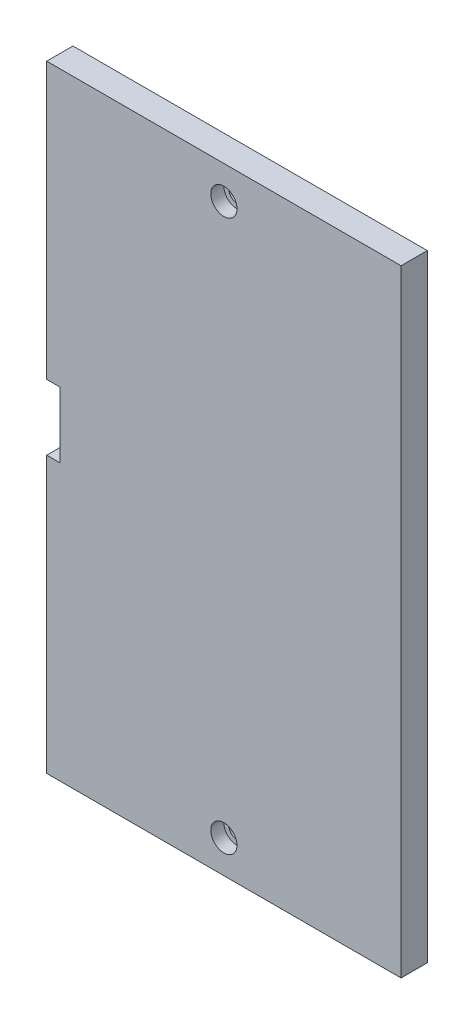
ISO-10303-21;
HEADER;
FILE_DESCRIPTION(('STEP AP214'),'2;1');
FILE_NAME('part.step','',(''),(''),'','','');
FILE_SCHEMA(('AUTOMOTIVE_DESIGN { 1 0 10303 214 1 1 1 1 }'));
ENDSEC;
DATA;
#1=APPLICATION_CONTEXT('core data for automotive mechanical design processes');
#2=APPLICATION_PROTOCOL_DEFINITION('international standard','automotive_design',2000,#1);
#3=PRODUCT_CONTEXT('',#1,'mechanical');
#4=PRODUCT('Part','Part','',(#3));
#5=PRODUCT_RELATED_PRODUCT_CATEGORY('part','',(#4));
#6=PRODUCT_DEFINITION_FORMATION('','',#4);
#7=PRODUCT_DEFINITION_CONTEXT('part definition',#1,'design');
#8=PRODUCT_DEFINITION('design','',#6,#7);
#9=PRODUCT_DEFINITION_SHAPE('','',#8);
#10=(LENGTH_UNIT() NAMED_UNIT(*) SI_UNIT(.MILLI.,.METRE.));
#11=(NAMED_UNIT(*) PLANE_ANGLE_UNIT() SI_UNIT($,.RADIAN.));
#12=(NAMED_UNIT(*) SI_UNIT($,.STERADIAN.) SOLID_ANGLE_UNIT());
#13=UNCERTAINTY_MEASURE_WITH_UNIT(LENGTH_MEASURE(1.E-05),#10,'distance_accuracy_value','');
#14=(GEOMETRIC_REPRESENTATION_CONTEXT(3) GLOBAL_UNCERTAINTY_ASSIGNED_CONTEXT((#13)) GLOBAL_UNIT_ASSIGNED_CONTEXT((#10,
#11,#12)) REPRESENTATION_CONTEXT('',''));
#15=CARTESIAN_POINT('',(0.,0.,0.));
#16=DIRECTION('',(0.,0.,1.));
#17=DIRECTION('',(1.,0.,0.));
#18=AXIS2_PLACEMENT_3D('',#15,#16,#17);
#19=CARTESIAN_POINT('',(27.,5.,0.));
#20=DIRECTION('',(0.,0.,1.));
#21=DIRECTION('',(1.,0.,0.));
#22=AXIS2_PLACEMENT_3D('',#19,#20,#21);
#23=CYLINDRICAL_SURFACE('',#22,1.25);
#24=CARTESIAN_POINT('',(27.,5.,0.));
#25=DIRECTION('',(0.,0.,1.));
#26=DIRECTION('',(1.,0.,0.));
#27=AXIS2_PLACEMENT_3D('',#24,#25,#26);
#28=CIRCLE('',#27,1.25);
#29=CARTESIAN_POINT('',(28.25,5.,0.));
#30=VERTEX_POINT('',#29);
#31=EDGE_CURVE('E165',#30,#30,#28,.T.);
#32=ORIENTED_EDGE('',*,*,#31,.F.);
#33=EDGE_LOOP('',(#32));
#34=FACE_BOUND('',#33,.T.);
#35=CARTESIAN_POINT('',(27.,5.,2.));
#36=DIRECTION('',(0.,0.,1.));
#37=DIRECTION('',(1.,0.,0.));
#38=AXIS2_PLACEMENT_3D('',#35,#36,#37);
#39=CIRCLE('',#38,1.25);
#40=CARTESIAN_POINT('',(28.25,5.,2.));
#41=VERTEX_POINT('',#40);
#42=EDGE_CURVE('E40',#41,#41,#39,.F.);
#43=ORIENTED_EDGE('',*,*,#42,.F.);
#44=EDGE_LOOP('',(#43));
#45=FACE_BOUND('',#44,.T.);
#46=ADVANCED_FACE('F35',(#34,#45),#23,.F.);
#47=CARTESIAN_POINT('',(27.,89.,0.));
#48=DIRECTION('',(0.,0.,1.));
#49=DIRECTION('',(1.,0.,0.));
#50=AXIS2_PLACEMENT_3D('',#47,#48,#49);
#51=CYLINDRICAL_SURFACE('',#50,1.25);
#52=CARTESIAN_POINT('',(27.,89.,0.));
#53=DIRECTION('',(0.,0.,1.));
#54=DIRECTION('',(1.,0.,0.));
#55=AXIS2_PLACEMENT_3D('',#52,#53,#54);
#56=CIRCLE('',#55,1.25);
#57=CARTESIAN_POINT('',(28.25,89.,0.));
#58=VERTEX_POINT('',#57);
#59=EDGE_CURVE('E128',#58,#58,#56,.T.);
#60=ORIENTED_EDGE('',*,*,#59,.F.);
#61=EDGE_LOOP('',(#60));
#62=FACE_BOUND('',#61,.T.);
#63=CARTESIAN_POINT('',(27.,89.,2.));
#64=DIRECTION('',(0.,0.,1.));
#65=DIRECTION('',(1.,0.,0.));
#66=AXIS2_PLACEMENT_3D('',#63,#64,#65);
#67=CIRCLE('',#66,1.25);
#68=CARTESIAN_POINT('',(28.25,89.,2.));
#69=VERTEX_POINT('',#68);
#70=EDGE_CURVE('E159',#69,#69,#67,.F.);
#71=ORIENTED_EDGE('',*,*,#70,.F.);
#72=EDGE_LOOP('',(#71));
#73=FACE_BOUND('',#72,.T.);
#74=ADVANCED_FACE('F236',(#62,#73),#51,.F.);
#75=CARTESIAN_POINT('',(0.,0.,4.));
#76=DIRECTION('',(1.,0.,0.));
#77=DIRECTION('',(0.,0.,-1.));
#78=AXIS2_PLACEMENT_3D('',#75,#76,#77);
#79=PLANE('',#78);
#80=DIRECTION('',(0.,-1.,0.));
#81=VECTOR('',#80,1.);
#82=CARTESIAN_POINT('',(0.,0.,0.));
#83=LINE('',#82,#81);
#84=CARTESIAN_POINT('',(0.,94.,0.));
#85=VERTEX_POINT('',#84);
#86=CARTESIAN_POINT('',(0.,52.,0.));
#87=VERTEX_POINT('',#86);
#88=EDGE_CURVE('E124',#85,#87,#83,.T.);
#89=ORIENTED_EDGE('',*,*,#88,.T.);
#90=DIRECTION('',(0.,0.,1.));
#91=VECTOR('',#90,1.);
#92=CARTESIAN_POINT('',(0.,52.,-0.00100000000000013));
#93=LINE('',#92,#91);
#94=CARTESIAN_POINT('',(0.,52.,4.));
#95=VERTEX_POINT('',#94);
#96=EDGE_CURVE('E106',#87,#95,#93,.T.);
#97=ORIENTED_EDGE('',*,*,#96,.T.);
#98=DIRECTION('',(0.,-1.,0.));
#99=VECTOR('',#98,1.);
#100=CARTESIAN_POINT('',(0.,0.,4.));
#101=LINE('',#100,#99);
#102=CARTESIAN_POINT('',(0.,94.,4.));
#103=VERTEX_POINT('',#102);
#104=EDGE_CURVE('E196',#103,#95,#101,.T.);
#105=ORIENTED_EDGE('',*,*,#104,.F.);
#106=DIRECTION('',(0.,0.,-1.));
#107=VECTOR('',#106,1.);
#108=CARTESIAN_POINT('',(0.,94.,4.));
#109=LINE('',#108,#107);
#110=EDGE_CURVE('E133',#103,#85,#109,.T.);
#111=ORIENTED_EDGE('',*,*,#110,.T.);
#112=EDGE_LOOP('',(#89,#97,#105,#111));
#113=FACE_BOUND('',#112,.T.);
#114=ADVANCED_FACE('F131',(#113),#79,.F.);
#115=CARTESIAN_POINT('',(0.,42.,4.));
#116=VERTEX_POINT('',#115);
#117=CARTESIAN_POINT('',(0.,0.,4.));
#118=VERTEX_POINT('',#117);
#119=EDGE_CURVE('E146',#116,#118,#101,.T.);
#120=ORIENTED_EDGE('',*,*,#119,.F.);
#121=DIRECTION('',(0.,0.,1.));
#122=VECTOR('',#121,1.);
#123=CARTESIAN_POINT('',(0.,42.,-0.00100000000000013));
#124=LINE('',#123,#122);
#125=CARTESIAN_POINT('',(0.,42.,0.));
#126=VERTEX_POINT('',#125);
#127=EDGE_CURVE('E189',#126,#116,#124,.T.);
#128=ORIENTED_EDGE('',*,*,#127,.F.);
#129=CARTESIAN_POINT('',(0.,0.,0.));
#130=VERTEX_POINT('',#129);
#131=EDGE_CURVE('E135',#126,#130,#83,.T.);
#132=ORIENTED_EDGE('',*,*,#131,.T.);
#133=DIRECTION('',(0.,0.,-1.));
#134=VECTOR('',#133,1.);
#135=CARTESIAN_POINT('',(0.,0.,4.));
#136=LINE('',#135,#134);
#137=EDGE_CURVE('E154',#118,#130,#136,.T.);
#138=ORIENTED_EDGE('',*,*,#137,.F.);
#139=EDGE_LOOP('',(#120,#128,#132,#138));
#140=FACE_BOUND('',#139,.T.);
#141=ADVANCED_FACE('F219',(#140),#79,.F.);
#142=CARTESIAN_POINT('',(0.,0.,4.));
#143=DIRECTION('',(0.,1.,0.));
#144=DIRECTION('',(0.,0.,1.));
#145=AXIS2_PLACEMENT_3D('',#142,#143,#144);
#146=PLANE('',#145);
#147=DIRECTION('',(1.,0.,0.));
#148=VECTOR('',#147,1.);
#149=CARTESIAN_POINT('',(0.,0.,0.));
#150=LINE('',#149,#148);
#151=CARTESIAN_POINT('',(54.,0.,0.));
#152=VERTEX_POINT('',#151);
#153=EDGE_CURVE('E134',#130,#152,#150,.T.);
#154=ORIENTED_EDGE('',*,*,#153,.T.);
#155=DIRECTION('',(0.,0.,-1.));
#156=VECTOR('',#155,1.);
#157=CARTESIAN_POINT('',(54.,0.,4.));
#158=LINE('',#157,#156);
#159=CARTESIAN_POINT('',(54.,0.,4.));
#160=VERTEX_POINT('',#159);
#161=EDGE_CURVE('E151',#160,#152,#158,.T.);
#162=ORIENTED_EDGE('',*,*,#161,.F.);
#163=DIRECTION('',(1.,0.,0.));
#164=VECTOR('',#163,1.);
#165=CARTESIAN_POINT('',(0.,0.,4.));
#166=LINE('',#165,#164);
#167=EDGE_CURVE('E198',#118,#160,#166,.T.);
#168=ORIENTED_EDGE('',*,*,#167,.F.);
#169=ORIENTED_EDGE('',*,*,#137,.T.);
#170=EDGE_LOOP('',(#154,#162,#168,#169));
#171=FACE_BOUND('',#170,.T.);
#172=ADVANCED_FACE('F215',(#171),#146,.F.);
#173=CARTESIAN_POINT('',(54.,0.,4.));
#174=DIRECTION('',(-1.,0.,0.));
#175=DIRECTION('',(0.,0.,1.));
#176=AXIS2_PLACEMENT_3D('',#173,#174,#175);
#177=PLANE('',#176);
#178=DIRECTION('',(0.,1.,0.));
#179=VECTOR('',#178,1.);
#180=CARTESIAN_POINT('',(54.,0.,0.));
#181=LINE('',#180,#179);
#182=CARTESIAN_POINT('',(54.,94.,0.));
#183=VERTEX_POINT('',#182);
#184=EDGE_CURVE('E137',#152,#183,#181,.T.);
#185=ORIENTED_EDGE('',*,*,#184,.T.);
#186=DIRECTION('',(0.,0.,-1.));
#187=VECTOR('',#186,1.);
#188=CARTESIAN_POINT('',(54.,94.,4.));
#189=LINE('',#188,#187);
#190=CARTESIAN_POINT('',(54.,94.,4.));
#191=VERTEX_POINT('',#190);
#192=EDGE_CURVE('E148',#191,#183,#189,.T.);
#193=ORIENTED_EDGE('',*,*,#192,.F.);
#194=DIRECTION('',(0.,1.,0.));
#195=VECTOR('',#194,1.);
#196=CARTESIAN_POINT('',(54.,0.,4.));
#197=LINE('',#196,#195);
#198=EDGE_CURVE('E199',#160,#191,#197,.T.);
#199=ORIENTED_EDGE('',*,*,#198,.F.);
#200=ORIENTED_EDGE('',*,*,#161,.T.);
#201=EDGE_LOOP('',(#185,#193,#199,#200));
#202=FACE_BOUND('',#201,.T.);
#203=ADVANCED_FACE('F211',(#202),#177,.F.);
#204=CARTESIAN_POINT('',(0.,94.,4.));
#205=DIRECTION('',(0.,-1.,0.));
#206=DIRECTION('',(0.,0.,-1.));
#207=AXIS2_PLACEMENT_3D('',#204,#205,#206);
#208=PLANE('',#207);
#209=DIRECTION('',(-1.,0.,0.));
#210=VECTOR('',#209,1.);
#211=CARTESIAN_POINT('',(0.,94.,0.));
#212=LINE('',#211,#210);
#213=EDGE_CURVE('E144',#183,#85,#212,.T.);
#214=ORIENTED_EDGE('',*,*,#213,.T.);
#215=ORIENTED_EDGE('',*,*,#110,.F.);
#216=DIRECTION('',(-1.,0.,0.));
#217=VECTOR('',#216,1.);
#218=CARTESIAN_POINT('',(0.,94.,4.));
#219=LINE('',#218,#217);
#220=EDGE_CURVE('E140',#191,#103,#219,.T.);
#221=ORIENTED_EDGE('',*,*,#220,.F.);
#222=ORIENTED_EDGE('',*,*,#192,.T.);
#223=EDGE_LOOP('',(#214,#215,#221,#222));
#224=FACE_BOUND('',#223,.T.);
#225=ADVANCED_FACE('F206',(#224),#208,.F.);
#226=CARTESIAN_POINT('',(0.,0.,4.));
#227=DIRECTION('',(0.,0.,-1.));
#228=DIRECTION('',(-1.,0.,0.));
#229=AXIS2_PLACEMENT_3D('',#226,#227,#228);
#230=PLANE('',#229);
#231=CARTESIAN_POINT('',(27.,89.,4.));
#232=DIRECTION('',(0.,0.,1.));
#233=DIRECTION('',(1.,0.,0.));
#234=AXIS2_PLACEMENT_3D('',#231,#232,#233);
#235=CIRCLE('',#234,2.);
#236=CARTESIAN_POINT('',(29.,89.,4.));
#237=VERTEX_POINT('',#236);
#238=EDGE_CURVE('E167',#237,#237,#235,.T.);
#239=ORIENTED_EDGE('',*,*,#238,.F.);
#240=EDGE_LOOP('',(#239));
#241=FACE_BOUND('',#240,.T.);
#242=CARTESIAN_POINT('',(27.,5.,4.));
#243=DIRECTION('',(0.,0.,1.));
#244=DIRECTION('',(1.,0.,0.));
#245=AXIS2_PLACEMENT_3D('',#242,#243,#244);
#246=CIRCLE('',#245,2.);
#247=CARTESIAN_POINT('',(29.,5.,4.));
#248=VERTEX_POINT('',#247);
#249=EDGE_CURVE('E177',#248,#248,#246,.T.);
#250=ORIENTED_EDGE('',*,*,#249,.F.);
#251=EDGE_LOOP('',(#250));
#252=FACE_BOUND('',#251,.T.);
#253=ORIENTED_EDGE('',*,*,#104,.T.);
#254=DIRECTION('',(-1.,0.,0.));
#255=VECTOR('',#254,1.);
#256=CARTESIAN_POINT('',(0.,52.,4.));
#257=LINE('',#256,#255);
#258=CARTESIAN_POINT('',(2.00000000000001,52.,4.));
#259=VERTEX_POINT('',#258);
#260=EDGE_CURVE('E111',#259,#95,#257,.T.);
#261=ORIENTED_EDGE('',*,*,#260,.F.);
#262=DIRECTION('',(0.,1.,0.));
#263=VECTOR('',#262,1.);
#264=CARTESIAN_POINT('',(2.00000000000001,52.,4.));
#265=LINE('',#264,#263);
#266=CARTESIAN_POINT('',(2.00000000000001,42.,4.));
#267=VERTEX_POINT('',#266);
#268=EDGE_CURVE('E186',#267,#259,#265,.T.);
#269=ORIENTED_EDGE('',*,*,#268,.F.);
#270=DIRECTION('',(1.,0.,0.));
#271=VECTOR('',#270,1.);
#272=CARTESIAN_POINT('',(2.00000000000001,42.,4.));
#273=LINE('',#272,#271);
#274=EDGE_CURVE('E127',#116,#267,#273,.T.);
#275=ORIENTED_EDGE('',*,*,#274,.F.);
#276=ORIENTED_EDGE('',*,*,#119,.T.);
#277=ORIENTED_EDGE('',*,*,#167,.T.);
#278=ORIENTED_EDGE('',*,*,#198,.T.);
#279=ORIENTED_EDGE('',*,*,#220,.T.);
#280=EDGE_LOOP('',(#253,#261,#269,#275,#276,#277,#278,#279));
#281=FACE_BOUND('',#280,.T.);
#282=ADVANCED_FACE('F204',(#241,#252,#281),#230,.F.);
#283=CARTESIAN_POINT('',(0.,0.,0.));
#284=DIRECTION('',(0.,0.,-1.));
#285=DIRECTION('',(-1.,0.,0.));
#286=AXIS2_PLACEMENT_3D('',#283,#284,#285);
#287=PLANE('',#286);
#288=ORIENTED_EDGE('',*,*,#59,.T.);
#289=EDGE_LOOP('',(#288));
#290=FACE_BOUND('',#289,.T.);
#291=ORIENTED_EDGE('',*,*,#31,.T.);
#292=EDGE_LOOP('',(#291));
#293=FACE_BOUND('',#292,.T.);
#294=DIRECTION('',(0.,1.,0.));
#295=VECTOR('',#294,1.);
#296=CARTESIAN_POINT('',(3.00000000000002,52.,0.));
#297=LINE('',#296,#295);
#298=CARTESIAN_POINT('',(3.00000000000002,42.,0.));
#299=VERTEX_POINT('',#298);
#300=CARTESIAN_POINT('',(3.00000000000002,52.,0.));
#301=VERTEX_POINT('',#300);
#302=EDGE_CURVE('E126',#299,#301,#297,.T.);
#303=ORIENTED_EDGE('',*,*,#302,.T.);
#304=DIRECTION('',(-1.,0.,0.));
#305=VECTOR('',#304,1.);
#306=CARTESIAN_POINT('',(0.,52.,0.));
#307=LINE('',#306,#305);
#308=EDGE_CURVE('E109',#301,#87,#307,.T.);
#309=ORIENTED_EDGE('',*,*,#308,.T.);
#310=ORIENTED_EDGE('',*,*,#88,.F.);
#311=ORIENTED_EDGE('',*,*,#213,.F.);
#312=ORIENTED_EDGE('',*,*,#184,.F.);
#313=ORIENTED_EDGE('',*,*,#153,.F.);
#314=ORIENTED_EDGE('',*,*,#131,.F.);
#315=DIRECTION('',(1.,0.,0.));
#316=VECTOR('',#315,1.);
#317=CARTESIAN_POINT('',(2.00000000000001,42.,0.));
#318=LINE('',#317,#316);
#319=EDGE_CURVE('E116',#126,#299,#318,.T.);
#320=ORIENTED_EDGE('',*,*,#319,.T.);
#321=EDGE_LOOP('',(#303,#309,#310,#311,#312,#313,#314,#320));
#322=FACE_BOUND('',#321,.T.);
#323=ADVANCED_FACE('F122',(#290,#293,#322),#287,.T.);
#324=CARTESIAN_POINT('',(0.,52.,-0.00100000000000013));
#325=DIRECTION('',(0.,1.,0.));
#326=DIRECTION('',(0.,0.,1.));
#327=AXIS2_PLACEMENT_3D('',#324,#325,#326);
#328=PLANE('',#327);
#329=ORIENTED_EDGE('',*,*,#308,.F.);
#330=DIRECTION('',(-0.707106781186548,0.,0.707106781186548));
#331=VECTOR('',#330,1.);
#332=CARTESIAN_POINT('',(1.50050000000001,52.,1.49950000000001));
#333=LINE('',#332,#331);
#334=CARTESIAN_POINT('',(2.00000000000001,52.,1.00000000000001));
#335=VERTEX_POINT('',#334);
#336=EDGE_CURVE('E45',#301,#335,#333,.T.);
#337=ORIENTED_EDGE('',*,*,#336,.T.);
#338=DIRECTION('',(0.,0.,1.));
#339=VECTOR('',#338,1.);
#340=CARTESIAN_POINT('',(2.00000000000001,52.,-0.00100000000000013));
#341=LINE('',#340,#339);
#342=EDGE_CURVE('E117',#335,#259,#341,.T.);
#343=ORIENTED_EDGE('',*,*,#342,.T.);
#344=ORIENTED_EDGE('',*,*,#260,.T.);
#345=ORIENTED_EDGE('',*,*,#96,.F.);
#346=EDGE_LOOP('',(#329,#337,#343,#344,#345));
#347=FACE_BOUND('',#346,.T.);
#348=ADVANCED_FACE('F108',(#347),#328,.F.);
#349=CARTESIAN_POINT('',(2.00000000000001,52.,-0.00100000000000013));
#350=DIRECTION('',(1.,0.,0.));
#351=DIRECTION('',(0.,1.,0.));
#352=AXIS2_PLACEMENT_3D('',#349,#350,#351);
#353=PLANE('',#352);
#354=ORIENTED_EDGE('',*,*,#342,.F.);
#355=DIRECTION('',(0.,-1.,0.));
#356=VECTOR('',#355,1.);
#357=CARTESIAN_POINT('',(2.00000000000001,42.,1.00000000000001));
#358=LINE('',#357,#356);
#359=CARTESIAN_POINT('',(2.00000000000001,42.,1.00000000000001));
#360=VERTEX_POINT('',#359);
#361=EDGE_CURVE('E59',#335,#360,#358,.T.);
#362=ORIENTED_EDGE('',*,*,#361,.T.);
#363=DIRECTION('',(0.,0.,1.));
#364=VECTOR('',#363,1.);
#365=CARTESIAN_POINT('',(2.00000000000001,42.,-0.00100000000000013));
#366=LINE('',#365,#364);
#367=EDGE_CURVE('E192',#360,#267,#366,.T.);
#368=ORIENTED_EDGE('',*,*,#367,.T.);
#369=ORIENTED_EDGE('',*,*,#268,.T.);
#370=EDGE_LOOP('',(#354,#362,#368,#369));
#371=FACE_BOUND('',#370,.T.);
#372=ADVANCED_FACE('F233',(#371),#353,.F.);
#373=CARTESIAN_POINT('',(2.00000000000001,42.,-0.00100000000000013));
#374=DIRECTION('',(0.,-1.,0.));
#375=DIRECTION('',(0.,0.,-1.));
#376=AXIS2_PLACEMENT_3D('',#373,#374,#375);
#377=PLANE('',#376);
#378=ORIENTED_EDGE('',*,*,#127,.T.);
#379=ORIENTED_EDGE('',*,*,#274,.T.);
#380=ORIENTED_EDGE('',*,*,#367,.F.);
#381=DIRECTION('',(0.707106781186548,0.,-0.707106781186548));
#382=VECTOR('',#381,1.);
#383=CARTESIAN_POINT('',(2.50050000000002,42.,0.499500000000007));
#384=LINE('',#383,#382);
#385=EDGE_CURVE('E11',#360,#299,#384,.T.);
#386=ORIENTED_EDGE('',*,*,#385,.T.);
#387=ORIENTED_EDGE('',*,*,#319,.F.);
#388=EDGE_LOOP('',(#378,#379,#380,#386,#387));
#389=FACE_BOUND('',#388,.T.);
#390=ADVANCED_FACE('F223',(#389),#377,.F.);
#391=CARTESIAN_POINT('',(3.00000000000003,0.,0.));
#392=DIRECTION('',(-0.707106781186547,0.,-0.707106781186547));
#393=DIRECTION('',(0.,-1.,0.));
#394=AXIS2_PLACEMENT_3D('',#391,#392,#393);
#395=PLANE('',#394);
#396=ORIENTED_EDGE('',*,*,#385,.F.);
#397=ORIENTED_EDGE('',*,*,#361,.F.);
#398=ORIENTED_EDGE('',*,*,#336,.F.);
#399=ORIENTED_EDGE('',*,*,#302,.F.);
#400=EDGE_LOOP('',(#396,#397,#398,#399));
#401=FACE_BOUND('',#400,.T.);
#402=ADVANCED_FACE('F38',(#401),#395,.T.);
#403=CARTESIAN_POINT('',(27.,89.,2.));
#404=DIRECTION('',(0.,0.,1.));
#405=DIRECTION('',(1.,0.,0.));
#406=AXIS2_PLACEMENT_3D('',#403,#404,#405);
#407=PLANE('',#406);
#408=CARTESIAN_POINT('',(27.,89.,2.));
#409=DIRECTION('',(0.,0.,1.));
#410=DIRECTION('',(1.,0.,0.));
#411=AXIS2_PLACEMENT_3D('',#408,#409,#410);
#412=CIRCLE('',#411,2.);
#413=CARTESIAN_POINT('',(29.,89.,2.));
#414=VERTEX_POINT('',#413);
#415=EDGE_CURVE('E161',#414,#414,#412,.T.);
#416=ORIENTED_EDGE('',*,*,#415,.T.);
#417=EDGE_LOOP('',(#416));
#418=FACE_BOUND('',#417,.T.);
#419=ORIENTED_EDGE('',*,*,#70,.T.);
#420=EDGE_LOOP('',(#419));
#421=FACE_BOUND('',#420,.T.);
#422=ADVANCED_FACE('F226',(#418,#421),#407,.T.);
#423=CARTESIAN_POINT('',(27.,89.,2.));
#424=DIRECTION('',(0.,0.,1.));
#425=DIRECTION('',(1.,0.,0.));
#426=AXIS2_PLACEMENT_3D('',#423,#424,#425);
#427=CYLINDRICAL_SURFACE('',#426,2.);
#428=ORIENTED_EDGE('',*,*,#415,.F.);
#429=EDGE_LOOP('',(#428));
#430=FACE_BOUND('',#429,.T.);
#431=ORIENTED_EDGE('',*,*,#238,.T.);
#432=EDGE_LOOP('',(#431));
#433=FACE_BOUND('',#432,.T.);
#434=ADVANCED_FACE('F231',(#430,#433),#427,.F.);
#435=CARTESIAN_POINT('',(27.,5.,2.));
#436=DIRECTION('',(0.,0.,1.));
#437=DIRECTION('',(1.,0.,0.));
#438=AXIS2_PLACEMENT_3D('',#435,#436,#437);
#439=PLANE('',#438);
#440=CARTESIAN_POINT('',(27.,5.,2.));
#441=DIRECTION('',(0.,0.,1.));
#442=DIRECTION('',(1.,0.,0.));
#443=AXIS2_PLACEMENT_3D('',#440,#441,#442);
#444=CIRCLE('',#443,2.);
#445=CARTESIAN_POINT('',(29.,5.,2.));
#446=VERTEX_POINT('',#445);
#447=EDGE_CURVE('E172',#446,#446,#444,.T.);
#448=ORIENTED_EDGE('',*,*,#447,.T.);
#449=EDGE_LOOP('',(#448));
#450=FACE_BOUND('',#449,.T.);
#451=ORIENTED_EDGE('',*,*,#42,.T.);
#452=EDGE_LOOP('',(#451));
#453=FACE_BOUND('',#452,.T.);
#454=ADVANCED_FACE('F300',(#450,#453),#439,.T.);
#455=CARTESIAN_POINT('',(27.,5.,2.));
#456=DIRECTION('',(0.,0.,1.));
#457=DIRECTION('',(1.,0.,0.));
#458=AXIS2_PLACEMENT_3D('',#455,#456,#457);
#459=CYLINDRICAL_SURFACE('',#458,2.);
#460=ORIENTED_EDGE('',*,*,#447,.F.);
#461=EDGE_LOOP('',(#460));
#462=FACE_BOUND('',#461,.T.);
#463=ORIENTED_EDGE('',*,*,#249,.T.);
#464=EDGE_LOOP('',(#463));
#465=FACE_BOUND('',#464,.T.);
#466=ADVANCED_FACE('F310',(#462,#465),#459,.F.);
#467=CLOSED_SHELL('',(#46,#74,#114,#141,#172,#203,#225,#282,#323,#348,#372,#390,#402,#422,#434,
#454,#466));
#468=MANIFOLD_SOLID_BREP('B2',#467);
#469=ADVANCED_BREP_SHAPE_REPRESENTATION('',(#18,#468),#14);
#470=SHAPE_DEFINITION_REPRESENTATION(#9,#469);
ENDSEC;
END-ISO-10303-21;
